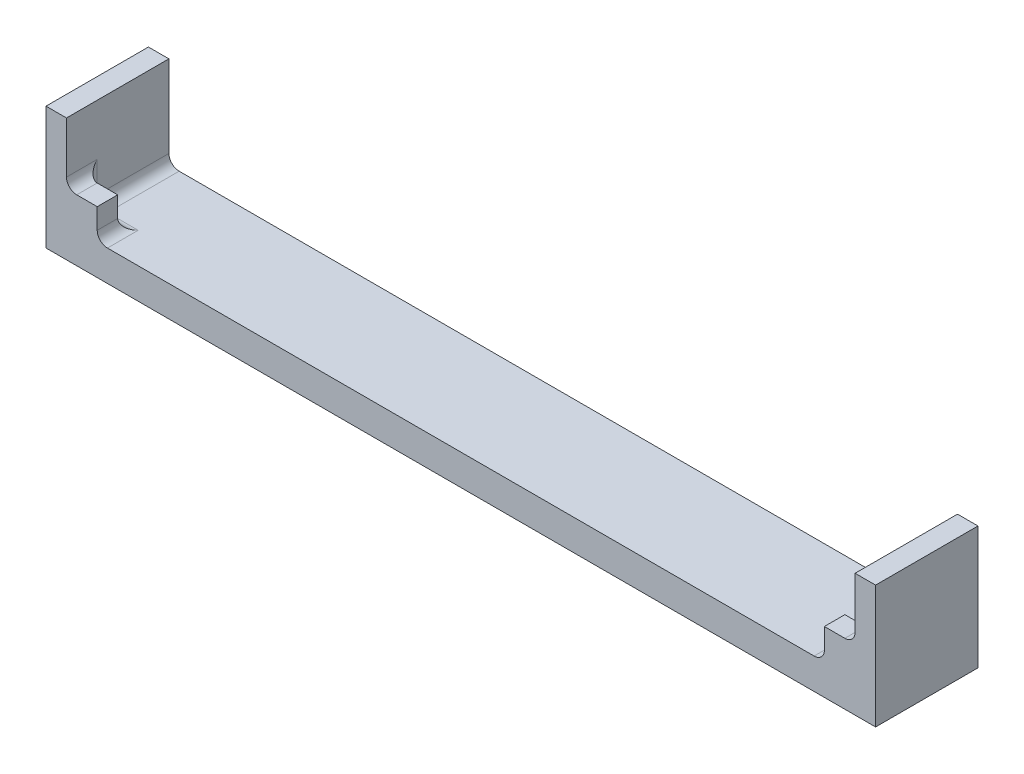
ISO-10303-21;
HEADER;
FILE_DESCRIPTION(('STEP AP214'),'2;1');
FILE_NAME('part.step','',(''),(''),'','','');
FILE_SCHEMA(('AUTOMOTIVE_DESIGN { 1 0 10303 214 1 1 1 1 }'));
ENDSEC;
DATA;
#1=APPLICATION_CONTEXT('core data for automotive mechanical design processes');
#2=APPLICATION_PROTOCOL_DEFINITION('international standard','automotive_design',2000,#1);
#3=PRODUCT_CONTEXT('',#1,'mechanical');
#4=PRODUCT('Part','Part','',(#3));
#5=PRODUCT_RELATED_PRODUCT_CATEGORY('part','',(#4));
#6=PRODUCT_DEFINITION_FORMATION('','',#4);
#7=PRODUCT_DEFINITION_CONTEXT('part definition',#1,'design');
#8=PRODUCT_DEFINITION('design','',#6,#7);
#9=PRODUCT_DEFINITION_SHAPE('','',#8);
#10=(LENGTH_UNIT() NAMED_UNIT(*) SI_UNIT(.MILLI.,.METRE.));
#11=(NAMED_UNIT(*) PLANE_ANGLE_UNIT() SI_UNIT($,.RADIAN.));
#12=(NAMED_UNIT(*) SI_UNIT($,.STERADIAN.) SOLID_ANGLE_UNIT());
#13=UNCERTAINTY_MEASURE_WITH_UNIT(LENGTH_MEASURE(1.E-05),#10,'distance_accuracy_value','');
#14=(GEOMETRIC_REPRESENTATION_CONTEXT(3) GLOBAL_UNCERTAINTY_ASSIGNED_CONTEXT((#13)) GLOBAL_UNIT_ASSIGNED_CONTEXT((#10,
#11,#12)) REPRESENTATION_CONTEXT('',''));
#15=CARTESIAN_POINT('',(0.,0.,0.));
#16=DIRECTION('',(0.,0.,1.));
#17=DIRECTION('',(1.,0.,0.));
#18=AXIS2_PLACEMENT_3D('',#15,#16,#17);
#19=CARTESIAN_POINT('',(0.,3.,0.));
#20=DIRECTION('',(0.,-1.,0.));
#21=DIRECTION('',(0.,0.,-1.));
#22=AXIS2_PLACEMENT_3D('',#19,#20,#21);
#23=PLANE('',#22);
#24=DIRECTION('',(0.,0.,1.));
#25=VECTOR('',#24,1.);
#26=CARTESIAN_POINT('',(75.,3.,0.));
#27=LINE('',#26,#25);
#28=CARTESIAN_POINT('',(75.,3.,0.));
#29=VERTEX_POINT('',#28);
#30=CARTESIAN_POINT('',(75.,3.,-3.));
#31=VERTEX_POINT('',#30);
#32=EDGE_CURVE('E346',#29,#31,#27,.F.);
#33=ORIENTED_EDGE('',*,*,#32,.T.);
#34=DIRECTION('',(1.,0.,0.));
#35=VECTOR('',#34,1.);
#36=CARTESIAN_POINT('',(78.,3.,-3.));
#37=LINE('',#36,#35);
#38=CARTESIAN_POINT('',(78.,3.,-3.));
#39=VERTEX_POINT('',#38);
#40=EDGE_CURVE('E349',#31,#39,#37,.T.);
#41=ORIENTED_EDGE('',*,*,#40,.T.);
#42=DIRECTION('',(0.,0.,1.));
#43=VECTOR('',#42,1.);
#44=CARTESIAN_POINT('',(78.,3.,-10.));
#45=LINE('',#44,#43);
#46=CARTESIAN_POINT('',(78.,3.,-10.));
#47=VERTEX_POINT('',#46);
#48=EDGE_CURVE('E322',#39,#47,#45,.F.);
#49=ORIENTED_EDGE('',*,*,#48,.T.);
#50=DIRECTION('',(-1.,0.,0.));
#51=VECTOR('',#50,1.);
#52=CARTESIAN_POINT('',(0.,3.,-10.));
#53=LINE('',#52,#51);
#54=CARTESIAN_POINT('',(3.,3.,-10.));
#55=VERTEX_POINT('',#54);
#56=EDGE_CURVE('E287',#47,#55,#53,.T.);
#57=ORIENTED_EDGE('',*,*,#56,.T.);
#58=DIRECTION('',(0.,0.,-1.));
#59=VECTOR('',#58,1.);
#60=CARTESIAN_POINT('',(3.,3.,-2.));
#61=LINE('',#60,#59);
#62=CARTESIAN_POINT('',(3.,3.,-3.));
#63=VERTEX_POINT('',#62);
#64=EDGE_CURVE('E325',#55,#63,#61,.F.);
#65=ORIENTED_EDGE('',*,*,#64,.T.);
#66=DIRECTION('',(1.,0.,0.));
#67=VECTOR('',#66,1.);
#68=CARTESIAN_POINT('',(0.,3.,-3.));
#69=LINE('',#68,#67);
#70=CARTESIAN_POINT('',(6.,3.,-3.));
#71=VERTEX_POINT('',#70);
#72=EDGE_CURVE('E342',#63,#71,#69,.T.);
#73=ORIENTED_EDGE('',*,*,#72,.T.);
#74=DIRECTION('',(0.,0.,1.));
#75=VECTOR('',#74,1.);
#76=CARTESIAN_POINT('',(6.,3.,0.));
#77=LINE('',#76,#75);
#78=CARTESIAN_POINT('',(6.,3.,0.));
#79=VERTEX_POINT('',#78);
#80=EDGE_CURVE('E339',#71,#79,#77,.T.);
#81=ORIENTED_EDGE('',*,*,#80,.T.);
#82=DIRECTION('',(1.,0.,0.));
#83=VECTOR('',#82,1.);
#84=CARTESIAN_POINT('',(0.,3.,0.));
#85=LINE('',#84,#83);
#86=EDGE_CURVE('E283',#79,#29,#85,.T.);
#87=ORIENTED_EDGE('',*,*,#86,.T.);
#88=EDGE_LOOP('',(#33,#41,#49,#57,#65,#73,#81,#87));
#89=FACE_BOUND('',#88,.T.);
#90=ADVANCED_FACE('F41',(#89),#23,.F.);
#91=CARTESIAN_POINT('',(0.,3.,0.));
#92=DIRECTION('',(1.,0.,0.));
#93=DIRECTION('',(0.,0.,-1.));
#94=AXIS2_PLACEMENT_3D('',#91,#92,#93);
#95=PLANE('',#94);
#96=DIRECTION('',(0.,0.,1.));
#97=VECTOR('',#96,1.);
#98=CARTESIAN_POINT('',(0.,0.,0.));
#99=LINE('',#98,#97);
#100=CARTESIAN_POINT('',(0.,0.,-10.));
#101=VERTEX_POINT('',#100);
#102=CARTESIAN_POINT('',(0.,0.,0.));
#103=VERTEX_POINT('',#102);
#104=EDGE_CURVE('E282',#101,#103,#99,.T.);
#105=ORIENTED_EDGE('',*,*,#104,.T.);
#106=DIRECTION('',(0.,-1.,0.));
#107=VECTOR('',#106,1.);
#108=CARTESIAN_POINT('',(0.,3.,0.));
#109=LINE('',#108,#107);
#110=CARTESIAN_POINT('',(0.,12.,0.));
#111=VERTEX_POINT('',#110);
#112=EDGE_CURVE('E315',#111,#103,#109,.T.);
#113=ORIENTED_EDGE('',*,*,#112,.F.);
#114=DIRECTION('',(0.,0.,1.));
#115=VECTOR('',#114,1.);
#116=CARTESIAN_POINT('',(0.,12.,-10.));
#117=LINE('',#116,#115);
#118=CARTESIAN_POINT('',(0.,12.,-10.));
#119=VERTEX_POINT('',#118);
#120=EDGE_CURVE('E261',#119,#111,#117,.T.);
#121=ORIENTED_EDGE('',*,*,#120,.F.);
#122=DIRECTION('',(0.,-1.,0.));
#123=VECTOR('',#122,1.);
#124=CARTESIAN_POINT('',(0.,3.,-10.));
#125=LINE('',#124,#123);
#126=EDGE_CURVE('E292',#119,#101,#125,.T.);
#127=ORIENTED_EDGE('',*,*,#126,.T.);
#128=EDGE_LOOP('',(#105,#113,#121,#127));
#129=FACE_BOUND('',#128,.T.);
#130=ADVANCED_FACE('F475',(#129),#95,.F.);
#131=CARTESIAN_POINT('',(0.,3.,0.));
#132=DIRECTION('',(0.,0.,-1.));
#133=DIRECTION('',(-1.,0.,0.));
#134=AXIS2_PLACEMENT_3D('',#131,#132,#133);
#135=PLANE('',#134);
#136=ORIENTED_EDGE('',*,*,#86,.F.);
#137=CARTESIAN_POINT('',(6.,4.,0.));
#138=DIRECTION('',(0.,0.,-1.));
#139=DIRECTION('',(-1.,0.,0.));
#140=AXIS2_PLACEMENT_3D('',#137,#138,#139);
#141=CIRCLE('',#140,1.);
#142=CARTESIAN_POINT('',(5.,4.,0.));
#143=VERTEX_POINT('',#142);
#144=EDGE_CURVE('E11',#79,#143,#141,.T.);
#145=ORIENTED_EDGE('',*,*,#144,.T.);
#146=DIRECTION('',(0.,1.,0.));
#147=VECTOR('',#146,1.);
#148=CARTESIAN_POINT('',(5.,3.,0.));
#149=LINE('',#148,#147);
#150=CARTESIAN_POINT('',(5.,6.,0.));
#151=VERTEX_POINT('',#150);
#152=EDGE_CURVE('E208',#143,#151,#149,.T.);
#153=ORIENTED_EDGE('',*,*,#152,.T.);
#154=DIRECTION('',(-1.,0.,0.));
#155=VECTOR('',#154,1.);
#156=CARTESIAN_POINT('',(2.,6.,0.));
#157=LINE('',#156,#155);
#158=CARTESIAN_POINT('',(3.,6.,0.));
#159=VERTEX_POINT('',#158);
#160=EDGE_CURVE('E226',#151,#159,#157,.T.);
#161=ORIENTED_EDGE('',*,*,#160,.T.);
#162=CARTESIAN_POINT('',(3.,7.,0.));
#163=DIRECTION('',(0.,0.,-1.));
#164=DIRECTION('',(-1.,0.,0.));
#165=AXIS2_PLACEMENT_3D('',#162,#163,#164);
#166=CIRCLE('',#165,1.);
#167=CARTESIAN_POINT('',(2.,7.,0.));
#168=VERTEX_POINT('',#167);
#169=EDGE_CURVE('E51',#159,#168,#166,.T.);
#170=ORIENTED_EDGE('',*,*,#169,.T.);
#171=DIRECTION('',(0.,-1.,0.));
#172=VECTOR('',#171,1.);
#173=CARTESIAN_POINT('',(2.,12.,0.));
#174=LINE('',#173,#172);
#175=CARTESIAN_POINT('',(2.,12.,0.));
#176=VERTEX_POINT('',#175);
#177=EDGE_CURVE('E279',#176,#168,#174,.T.);
#178=ORIENTED_EDGE('',*,*,#177,.F.);
#179=DIRECTION('',(1.,0.,0.));
#180=VECTOR('',#179,1.);
#181=CARTESIAN_POINT('',(0.,12.,0.));
#182=LINE('',#181,#180);
#183=EDGE_CURVE('E265',#111,#176,#182,.T.);
#184=ORIENTED_EDGE('',*,*,#183,.F.);
#185=ORIENTED_EDGE('',*,*,#112,.T.);
#186=DIRECTION('',(1.,0.,0.));
#187=VECTOR('',#186,1.);
#188=CARTESIAN_POINT('',(0.,0.,0.));
#189=LINE('',#188,#187);
#190=CARTESIAN_POINT('',(81.,0.,0.));
#191=VERTEX_POINT('',#190);
#192=EDGE_CURVE('E296',#103,#191,#189,.T.);
#193=ORIENTED_EDGE('',*,*,#192,.T.);
#194=DIRECTION('',(0.,-1.,0.));
#195=VECTOR('',#194,1.);
#196=CARTESIAN_POINT('',(81.,3.,0.));
#197=LINE('',#196,#195);
#198=CARTESIAN_POINT('',(81.,12.,0.));
#199=VERTEX_POINT('',#198);
#200=EDGE_CURVE('E311',#199,#191,#197,.T.);
#201=ORIENTED_EDGE('',*,*,#200,.F.);
#202=DIRECTION('',(1.,0.,0.));
#203=VECTOR('',#202,1.);
#204=CARTESIAN_POINT('',(81.,12.,0.));
#205=LINE('',#204,#203);
#206=CARTESIAN_POINT('',(79.,12.,0.));
#207=VERTEX_POINT('',#206);
#208=EDGE_CURVE('E249',#207,#199,#205,.T.);
#209=ORIENTED_EDGE('',*,*,#208,.F.);
#210=DIRECTION('',(0.,-1.,0.));
#211=VECTOR('',#210,1.);
#212=CARTESIAN_POINT('',(79.,12.,0.));
#213=LINE('',#212,#211);
#214=CARTESIAN_POINT('',(79.,7.,0.));
#215=VERTEX_POINT('',#214);
#216=EDGE_CURVE('E253',#207,#215,#213,.T.);
#217=ORIENTED_EDGE('',*,*,#216,.T.);
#218=CARTESIAN_POINT('',(78.,7.,0.));
#219=DIRECTION('',(0.,0.,-1.));
#220=DIRECTION('',(-1.,0.,0.));
#221=AXIS2_PLACEMENT_3D('',#218,#219,#220);
#222=CIRCLE('',#221,1.);
#223=CARTESIAN_POINT('',(78.,6.,0.));
#224=VERTEX_POINT('',#223);
#225=EDGE_CURVE('E395',#215,#224,#222,.T.);
#226=ORIENTED_EDGE('',*,*,#225,.T.);
#227=DIRECTION('',(-1.,0.,0.));
#228=VECTOR('',#227,1.);
#229=CARTESIAN_POINT('',(79.,6.,0.));
#230=LINE('',#229,#228);
#231=CARTESIAN_POINT('',(76.,6.,0.));
#232=VERTEX_POINT('',#231);
#233=EDGE_CURVE('E216',#224,#232,#230,.T.);
#234=ORIENTED_EDGE('',*,*,#233,.T.);
#235=DIRECTION('',(0.,-1.,0.));
#236=VECTOR('',#235,1.);
#237=CARTESIAN_POINT('',(76.,3.,0.));
#238=LINE('',#237,#236);
#239=CARTESIAN_POINT('',(76.,4.,0.));
#240=VERTEX_POINT('',#239);
#241=EDGE_CURVE('E200',#232,#240,#238,.T.);
#242=ORIENTED_EDGE('',*,*,#241,.T.);
#243=CARTESIAN_POINT('',(75.,4.,0.));
#244=DIRECTION('',(0.,0.,-1.));
#245=DIRECTION('',(-1.,0.,0.));
#246=AXIS2_PLACEMENT_3D('',#243,#244,#245);
#247=CIRCLE('',#246,1.);
#248=EDGE_CURVE('E392',#240,#29,#247,.T.);
#249=ORIENTED_EDGE('',*,*,#248,.T.);
#250=EDGE_LOOP('',(#136,#145,#153,#161,#170,#178,#184,#185,#193,#201,#209,#217,#226,#234,#242,#249));
#251=FACE_BOUND('',#250,.T.);
#252=ADVANCED_FACE('F441',(#251),#135,.F.);
#253=CARTESIAN_POINT('',(81.,3.,0.));
#254=DIRECTION('',(-1.,0.,0.));
#255=DIRECTION('',(0.,0.,1.));
#256=AXIS2_PLACEMENT_3D('',#253,#254,#255);
#257=PLANE('',#256);
#258=DIRECTION('',(0.,0.,-1.));
#259=VECTOR('',#258,1.);
#260=CARTESIAN_POINT('',(81.,0.,0.));
#261=LINE('',#260,#259);
#262=CARTESIAN_POINT('',(81.,0.,-10.));
#263=VERTEX_POINT('',#262);
#264=EDGE_CURVE('E299',#191,#263,#261,.T.);
#265=ORIENTED_EDGE('',*,*,#264,.T.);
#266=DIRECTION('',(0.,-1.,0.));
#267=VECTOR('',#266,1.);
#268=CARTESIAN_POINT('',(81.,3.,-10.));
#269=LINE('',#268,#267);
#270=CARTESIAN_POINT('',(81.,12.,-10.));
#271=VERTEX_POINT('',#270);
#272=EDGE_CURVE('E307',#271,#263,#269,.T.);
#273=ORIENTED_EDGE('',*,*,#272,.F.);
#274=DIRECTION('',(0.,0.,-1.));
#275=VECTOR('',#274,1.);
#276=CARTESIAN_POINT('',(81.,12.,-10.));
#277=LINE('',#276,#275);
#278=EDGE_CURVE('E239',#199,#271,#277,.T.);
#279=ORIENTED_EDGE('',*,*,#278,.F.);
#280=ORIENTED_EDGE('',*,*,#200,.T.);
#281=EDGE_LOOP('',(#265,#273,#279,#280));
#282=FACE_BOUND('',#281,.T.);
#283=ADVANCED_FACE('F483',(#282),#257,.F.);
#284=CARTESIAN_POINT('',(0.,3.,-10.));
#285=DIRECTION('',(0.,0.,1.));
#286=DIRECTION('',(1.,0.,0.));
#287=AXIS2_PLACEMENT_3D('',#284,#285,#286);
#288=PLANE('',#287);
#289=DIRECTION('',(-1.,0.,0.));
#290=VECTOR('',#289,1.);
#291=CARTESIAN_POINT('',(0.,0.,-10.));
#292=LINE('',#291,#290);
#293=EDGE_CURVE('E288',#263,#101,#292,.T.);
#294=ORIENTED_EDGE('',*,*,#293,.T.);
#295=ORIENTED_EDGE('',*,*,#126,.F.);
#296=DIRECTION('',(-1.,0.,0.));
#297=VECTOR('',#296,1.);
#298=CARTESIAN_POINT('',(0.,12.,-10.));
#299=LINE('',#298,#297);
#300=CARTESIAN_POINT('',(2.,12.,-10.));
#301=VERTEX_POINT('',#300);
#302=EDGE_CURVE('E271',#301,#119,#299,.T.);
#303=ORIENTED_EDGE('',*,*,#302,.F.);
#304=DIRECTION('',(0.,-1.,0.));
#305=VECTOR('',#304,1.);
#306=CARTESIAN_POINT('',(2.,12.,-10.));
#307=LINE('',#306,#305);
#308=CARTESIAN_POINT('',(2.,4.,-10.));
#309=VERTEX_POINT('',#308);
#310=EDGE_CURVE('E275',#301,#309,#307,.T.);
#311=ORIENTED_EDGE('',*,*,#310,.T.);
#312=CARTESIAN_POINT('',(3.,4.,-10.));
#313=DIRECTION('',(0.,0.,1.));
#314=DIRECTION('',(1.,0.,0.));
#315=AXIS2_PLACEMENT_3D('',#312,#313,#314);
#316=CIRCLE('',#315,1.);
#317=EDGE_CURVE('E333',#309,#55,#316,.T.);
#318=ORIENTED_EDGE('',*,*,#317,.T.);
#319=ORIENTED_EDGE('',*,*,#56,.F.);
#320=CARTESIAN_POINT('',(78.,4.,-10.));
#321=DIRECTION('',(0.,0.,1.));
#322=DIRECTION('',(1.,0.,0.));
#323=AXIS2_PLACEMENT_3D('',#320,#321,#322);
#324=CIRCLE('',#323,1.);
#325=CARTESIAN_POINT('',(79.,4.,-10.));
#326=VERTEX_POINT('',#325);
#327=EDGE_CURVE('E336',#47,#326,#324,.T.);
#328=ORIENTED_EDGE('',*,*,#327,.T.);
#329=DIRECTION('',(0.,-1.,0.));
#330=VECTOR('',#329,1.);
#331=CARTESIAN_POINT('',(79.,12.,-10.));
#332=LINE('',#331,#330);
#333=CARTESIAN_POINT('',(79.,12.,-10.));
#334=VERTEX_POINT('',#333);
#335=EDGE_CURVE('E257',#334,#326,#332,.T.);
#336=ORIENTED_EDGE('',*,*,#335,.F.);
#337=DIRECTION('',(-1.,0.,0.));
#338=VECTOR('',#337,1.);
#339=CARTESIAN_POINT('',(81.,12.,-10.));
#340=LINE('',#339,#338);
#341=EDGE_CURVE('E243',#271,#334,#340,.T.);
#342=ORIENTED_EDGE('',*,*,#341,.F.);
#343=ORIENTED_EDGE('',*,*,#272,.T.);
#344=EDGE_LOOP('',(#294,#295,#303,#311,#318,#319,#328,#336,#342,#343));
#345=FACE_BOUND('',#344,.T.);
#346=ADVANCED_FACE('F470',(#345),#288,.F.);
#347=CARTESIAN_POINT('',(0.,0.,0.));
#348=DIRECTION('',(0.,-1.,0.));
#349=DIRECTION('',(0.,0.,-1.));
#350=AXIS2_PLACEMENT_3D('',#347,#348,#349);
#351=PLANE('',#350);
#352=ORIENTED_EDGE('',*,*,#104,.F.);
#353=ORIENTED_EDGE('',*,*,#293,.F.);
#354=ORIENTED_EDGE('',*,*,#264,.F.);
#355=ORIENTED_EDGE('',*,*,#192,.F.);
#356=EDGE_LOOP('',(#352,#353,#354,#355));
#357=FACE_BOUND('',#356,.T.);
#358=ADVANCED_FACE('F485',(#357),#351,.T.);
#359=CARTESIAN_POINT('',(2.,12.,-10.));
#360=DIRECTION('',(-1.,0.,0.));
#361=DIRECTION('',(0.,0.,1.));
#362=AXIS2_PLACEMENT_3D('',#359,#360,#361);
#363=PLANE('',#362);
#364=ORIENTED_EDGE('',*,*,#177,.T.);
#365=DIRECTION('',(0.,0.,1.));
#366=VECTOR('',#365,1.);
#367=CARTESIAN_POINT('',(2.,7.,-10.));
#368=LINE('',#367,#366);
#369=CARTESIAN_POINT('',(2.,7.,-3.));
#370=VERTEX_POINT('',#369);
#371=EDGE_CURVE('E65',#168,#370,#368,.F.);
#372=ORIENTED_EDGE('',*,*,#371,.T.);
#373=DIRECTION('',(0.,-1.,0.));
#374=VECTOR('',#373,1.);
#375=CARTESIAN_POINT('',(2.,12.,-3.));
#376=LINE('',#375,#374);
#377=CARTESIAN_POINT('',(2.,4.,-3.));
#378=VERTEX_POINT('',#377);
#379=EDGE_CURVE('E384',#370,#378,#376,.T.);
#380=ORIENTED_EDGE('',*,*,#379,.T.);
#381=DIRECTION('',(0.,0.,-1.));
#382=VECTOR('',#381,1.);
#383=CARTESIAN_POINT('',(2.,4.,-10.));
#384=LINE('',#383,#382);
#385=EDGE_CURVE('E319',#378,#309,#384,.T.);
#386=ORIENTED_EDGE('',*,*,#385,.T.);
#387=ORIENTED_EDGE('',*,*,#310,.F.);
#388=DIRECTION('',(0.,0.,-1.));
#389=VECTOR('',#388,1.);
#390=CARTESIAN_POINT('',(2.,12.,-10.));
#391=LINE('',#390,#389);
#392=EDGE_CURVE('E268',#176,#301,#391,.T.);
#393=ORIENTED_EDGE('',*,*,#392,.F.);
#394=EDGE_LOOP('',(#364,#372,#380,#386,#387,#393));
#395=FACE_BOUND('',#394,.T.);
#396=ADVANCED_FACE('F466',(#395),#363,.F.);
#397=CARTESIAN_POINT('',(0.,12.,0.));
#398=DIRECTION('',(0.,1.,0.));
#399=DIRECTION('',(0.,0.,1.));
#400=AXIS2_PLACEMENT_3D('',#397,#398,#399);
#401=PLANE('',#400);
#402=ORIENTED_EDGE('',*,*,#120,.T.);
#403=ORIENTED_EDGE('',*,*,#183,.T.);
#404=ORIENTED_EDGE('',*,*,#392,.T.);
#405=ORIENTED_EDGE('',*,*,#302,.T.);
#406=EDGE_LOOP('',(#402,#403,#404,#405));
#407=FACE_BOUND('',#406,.T.);
#408=ADVANCED_FACE('F473',(#407),#401,.T.);
#409=CARTESIAN_POINT('',(79.,12.,-10.));
#410=DIRECTION('',(1.,0.,0.));
#411=DIRECTION('',(0.,0.,-1.));
#412=AXIS2_PLACEMENT_3D('',#409,#410,#411);
#413=PLANE('',#412);
#414=DIRECTION('',(0.,0.,1.));
#415=VECTOR('',#414,1.);
#416=CARTESIAN_POINT('',(79.,4.,-2.));
#417=LINE('',#416,#415);
#418=CARTESIAN_POINT('',(79.,4.,-3.));
#419=VERTEX_POINT('',#418);
#420=EDGE_CURVE('E329',#326,#419,#417,.T.);
#421=ORIENTED_EDGE('',*,*,#420,.T.);
#422=DIRECTION('',(0.,1.,0.));
#423=VECTOR('',#422,1.);
#424=CARTESIAN_POINT('',(79.,6.,-3.));
#425=LINE('',#424,#423);
#426=CARTESIAN_POINT('',(79.,7.,-3.));
#427=VERTEX_POINT('',#426);
#428=EDGE_CURVE('E376',#419,#427,#425,.T.);
#429=ORIENTED_EDGE('',*,*,#428,.T.);
#430=DIRECTION('',(0.,0.,1.));
#431=VECTOR('',#430,1.);
#432=CARTESIAN_POINT('',(79.,7.,-10.));
#433=LINE('',#432,#431);
#434=EDGE_CURVE('E373',#427,#215,#433,.T.);
#435=ORIENTED_EDGE('',*,*,#434,.T.);
#436=ORIENTED_EDGE('',*,*,#216,.F.);
#437=DIRECTION('',(0.,0.,1.));
#438=VECTOR('',#437,1.);
#439=CARTESIAN_POINT('',(79.,12.,-10.));
#440=LINE('',#439,#438);
#441=EDGE_CURVE('E246',#334,#207,#440,.T.);
#442=ORIENTED_EDGE('',*,*,#441,.F.);
#443=ORIENTED_EDGE('',*,*,#335,.T.);
#444=EDGE_LOOP('',(#421,#429,#435,#436,#442,#443));
#445=FACE_BOUND('',#444,.T.);
#446=ADVANCED_FACE('F516',(#445),#413,.F.);
#447=CARTESIAN_POINT('',(0.,12.,0.));
#448=DIRECTION('',(0.,-1.,0.));
#449=DIRECTION('',(0.,0.,-1.));
#450=AXIS2_PLACEMENT_3D('',#447,#448,#449);
#451=PLANE('',#450);
#452=ORIENTED_EDGE('',*,*,#278,.T.);
#453=ORIENTED_EDGE('',*,*,#341,.T.);
#454=ORIENTED_EDGE('',*,*,#441,.T.);
#455=ORIENTED_EDGE('',*,*,#208,.T.);
#456=EDGE_LOOP('',(#452,#453,#454,#455));
#457=FACE_BOUND('',#456,.T.);
#458=ADVANCED_FACE('F490',(#457),#451,.F.);
#459=CARTESIAN_POINT('',(2.,6.,-2.));
#460=DIRECTION('',(0.,1.,0.));
#461=DIRECTION('',(0.,0.,1.));
#462=AXIS2_PLACEMENT_3D('',#459,#460,#461);
#463=PLANE('',#462);
#464=DIRECTION('',(-1.,0.,0.));
#465=VECTOR('',#464,1.);
#466=CARTESIAN_POINT('',(2.,6.,-2.));
#467=LINE('',#466,#465);
#468=CARTESIAN_POINT('',(5.,6.,-2.));
#469=VERTEX_POINT('',#468);
#470=CARTESIAN_POINT('',(3.,6.,-2.));
#471=VERTEX_POINT('',#470);
#472=EDGE_CURVE('E225',#469,#471,#467,.T.);
#473=ORIENTED_EDGE('',*,*,#472,.T.);
#474=DIRECTION('',(0.,0.,1.));
#475=VECTOR('',#474,1.);
#476=CARTESIAN_POINT('',(3.,6.,-2.));
#477=LINE('',#476,#475);
#478=EDGE_CURVE('E381',#471,#159,#477,.T.);
#479=ORIENTED_EDGE('',*,*,#478,.T.);
#480=ORIENTED_EDGE('',*,*,#160,.F.);
#481=DIRECTION('',(0.,0.,1.));
#482=VECTOR('',#481,1.);
#483=CARTESIAN_POINT('',(5.,6.,-2.));
#484=LINE('',#483,#482);
#485=EDGE_CURVE('E230',#469,#151,#484,.T.);
#486=ORIENTED_EDGE('',*,*,#485,.F.);
#487=EDGE_LOOP('',(#473,#479,#480,#486));
#488=FACE_BOUND('',#487,.T.);
#489=ADVANCED_FACE('F438',(#488),#463,.T.);
#490=CARTESIAN_POINT('',(5.,3.,-2.));
#491=DIRECTION('',(1.,0.,0.));
#492=DIRECTION('',(0.,0.,-1.));
#493=AXIS2_PLACEMENT_3D('',#490,#491,#492);
#494=PLANE('',#493);
#495=ORIENTED_EDGE('',*,*,#152,.F.);
#496=DIRECTION('',(0.,0.,1.));
#497=VECTOR('',#496,1.);
#498=CARTESIAN_POINT('',(5.,4.,-2.));
#499=LINE('',#498,#497);
#500=CARTESIAN_POINT('',(5.,4.,-2.));
#501=VERTEX_POINT('',#500);
#502=EDGE_CURVE('E389',#143,#501,#499,.F.);
#503=ORIENTED_EDGE('',*,*,#502,.T.);
#504=DIRECTION('',(0.,1.,0.));
#505=VECTOR('',#504,1.);
#506=CARTESIAN_POINT('',(5.,3.,-2.));
#507=LINE('',#506,#505);
#508=EDGE_CURVE('E222',#501,#469,#507,.T.);
#509=ORIENTED_EDGE('',*,*,#508,.T.);
#510=ORIENTED_EDGE('',*,*,#485,.T.);
#511=EDGE_LOOP('',(#495,#503,#509,#510));
#512=FACE_BOUND('',#511,.T.);
#513=ADVANCED_FACE('F445',(#512),#494,.T.);
#514=CARTESIAN_POINT('',(0.,0.,-2.));
#515=DIRECTION('',(0.,0.,-1.));
#516=DIRECTION('',(-1.,0.,0.));
#517=AXIS2_PLACEMENT_3D('',#514,#515,#516);
#518=PLANE('',#517);
#519=ORIENTED_EDGE('',*,*,#508,.F.);
#520=DIRECTION('',(1.,0.,0.));
#521=VECTOR('',#520,1.);
#522=CARTESIAN_POINT('',(0.,4.,-2.));
#523=LINE('',#522,#521);
#524=CARTESIAN_POINT('',(3.,4.,-2.));
#525=VERTEX_POINT('',#524);
#526=EDGE_CURVE('E364',#501,#525,#523,.F.);
#527=ORIENTED_EDGE('',*,*,#526,.T.);
#528=DIRECTION('',(0.,-1.,0.));
#529=VECTOR('',#528,1.);
#530=CARTESIAN_POINT('',(3.,0.,-2.));
#531=LINE('',#530,#529);
#532=EDGE_CURVE('E361',#525,#471,#531,.F.);
#533=ORIENTED_EDGE('',*,*,#532,.T.);
#534=ORIENTED_EDGE('',*,*,#472,.F.);
#535=EDGE_LOOP('',(#519,#527,#533,#534));
#536=FACE_BOUND('',#535,.T.);
#537=ADVANCED_FACE('F448',(#536),#518,.T.);
#538=CARTESIAN_POINT('',(76.,3.,-2.));
#539=DIRECTION('',(-1.,0.,0.));
#540=DIRECTION('',(0.,0.,1.));
#541=AXIS2_PLACEMENT_3D('',#538,#539,#540);
#542=PLANE('',#541);
#543=DIRECTION('',(0.,-1.,0.));
#544=VECTOR('',#543,1.);
#545=CARTESIAN_POINT('',(76.,3.,-2.));
#546=LINE('',#545,#544);
#547=CARTESIAN_POINT('',(76.,6.,-2.));
#548=VERTEX_POINT('',#547);
#549=CARTESIAN_POINT('',(76.,4.,-2.));
#550=VERTEX_POINT('',#549);
#551=EDGE_CURVE('E199',#548,#550,#546,.T.);
#552=ORIENTED_EDGE('',*,*,#551,.T.);
#553=DIRECTION('',(0.,0.,1.));
#554=VECTOR('',#553,1.);
#555=CARTESIAN_POINT('',(76.,4.,-2.));
#556=LINE('',#555,#554);
#557=EDGE_CURVE('E370',#550,#240,#556,.T.);
#558=ORIENTED_EDGE('',*,*,#557,.T.);
#559=ORIENTED_EDGE('',*,*,#241,.F.);
#560=DIRECTION('',(0.,0.,1.));
#561=VECTOR('',#560,1.);
#562=CARTESIAN_POINT('',(76.,6.,-2.));
#563=LINE('',#562,#561);
#564=EDGE_CURVE('E191',#548,#232,#563,.T.);
#565=ORIENTED_EDGE('',*,*,#564,.F.);
#566=EDGE_LOOP('',(#552,#558,#559,#565));
#567=FACE_BOUND('',#566,.T.);
#568=ADVANCED_FACE('F204',(#567),#542,.T.);
#569=CARTESIAN_POINT('',(79.,6.,-2.));
#570=DIRECTION('',(0.,1.,0.));
#571=DIRECTION('',(0.,0.,1.));
#572=AXIS2_PLACEMENT_3D('',#569,#570,#571);
#573=PLANE('',#572);
#574=ORIENTED_EDGE('',*,*,#233,.F.);
#575=DIRECTION('',(0.,0.,1.));
#576=VECTOR('',#575,1.);
#577=CARTESIAN_POINT('',(78.,6.,-2.));
#578=LINE('',#577,#576);
#579=CARTESIAN_POINT('',(78.,6.,-2.));
#580=VERTEX_POINT('',#579);
#581=EDGE_CURVE('E194',#224,#580,#578,.F.);
#582=ORIENTED_EDGE('',*,*,#581,.T.);
#583=DIRECTION('',(-1.,0.,0.));
#584=VECTOR('',#583,1.);
#585=CARTESIAN_POINT('',(79.,6.,-2.));
#586=LINE('',#585,#584);
#587=EDGE_CURVE('E187',#580,#548,#586,.T.);
#588=ORIENTED_EDGE('',*,*,#587,.T.);
#589=ORIENTED_EDGE('',*,*,#564,.T.);
#590=EDGE_LOOP('',(#574,#582,#588,#589));
#591=FACE_BOUND('',#590,.T.);
#592=ADVANCED_FACE('F190',(#591),#573,.T.);
#593=CARTESIAN_POINT('',(0.,0.,-2.));
#594=DIRECTION('',(0.,0.,1.));
#595=DIRECTION('',(1.,0.,0.));
#596=AXIS2_PLACEMENT_3D('',#593,#594,#595);
#597=PLANE('',#596);
#598=DIRECTION('',(0.,1.,0.));
#599=VECTOR('',#598,1.);
#600=CARTESIAN_POINT('',(78.,4.,-2.));
#601=LINE('',#600,#599);
#602=CARTESIAN_POINT('',(78.,4.,-2.));
#603=VERTEX_POINT('',#602);
#604=EDGE_CURVE('E353',#580,#603,#601,.F.);
#605=ORIENTED_EDGE('',*,*,#604,.T.);
#606=DIRECTION('',(1.,0.,0.));
#607=VECTOR('',#606,1.);
#608=CARTESIAN_POINT('',(76.,4.,-2.));
#609=LINE('',#608,#607);
#610=EDGE_CURVE('E212',#603,#550,#609,.F.);
#611=ORIENTED_EDGE('',*,*,#610,.T.);
#612=ORIENTED_EDGE('',*,*,#551,.F.);
#613=ORIENTED_EDGE('',*,*,#587,.F.);
#614=EDGE_LOOP('',(#605,#611,#612,#613));
#615=FACE_BOUND('',#614,.T.);
#616=ADVANCED_FACE('F210',(#615),#597,.F.);
#617=CARTESIAN_POINT('',(3.,4.,-10.));
#618=DIRECTION('',(0.,0.,1.));
#619=DIRECTION('',(1.,0.,0.));
#620=AXIS2_PLACEMENT_3D('',#617,#618,#619);
#621=CYLINDRICAL_SURFACE('',#620,1.);
#622=ORIENTED_EDGE('',*,*,#385,.F.);
#623=CARTESIAN_POINT('',(3.,4.,-3.));
#624=DIRECTION('',(0.,0.,1.));
#625=DIRECTION('',(1.,0.,0.));
#626=AXIS2_PLACEMENT_3D('',#623,#624,#625);
#627=CIRCLE('',#626,1.);
#628=EDGE_CURVE('E367',#378,#63,#627,.T.);
#629=ORIENTED_EDGE('',*,*,#628,.T.);
#630=ORIENTED_EDGE('',*,*,#64,.F.);
#631=ORIENTED_EDGE('',*,*,#317,.F.);
#632=EDGE_LOOP('',(#622,#629,#630,#631));
#633=FACE_BOUND('',#632,.T.);
#634=ADVANCED_FACE('F464',(#633),#621,.F.);
#635=CARTESIAN_POINT('',(78.,4.,-10.));
#636=DIRECTION('',(0.,0.,-1.));
#637=DIRECTION('',(-1.,0.,0.));
#638=AXIS2_PLACEMENT_3D('',#635,#636,#637);
#639=CYLINDRICAL_SURFACE('',#638,1.);
#640=ORIENTED_EDGE('',*,*,#48,.F.);
#641=CARTESIAN_POINT('',(78.,4.,-3.));
#642=DIRECTION('',(0.,0.,-1.));
#643=DIRECTION('',(-1.,0.,0.));
#644=AXIS2_PLACEMENT_3D('',#641,#642,#643);
#645=CIRCLE('',#644,1.);
#646=EDGE_CURVE('E358',#39,#419,#645,.F.);
#647=ORIENTED_EDGE('',*,*,#646,.T.);
#648=ORIENTED_EDGE('',*,*,#420,.F.);
#649=ORIENTED_EDGE('',*,*,#327,.F.);
#650=EDGE_LOOP('',(#640,#647,#648,#649));
#651=FACE_BOUND('',#650,.T.);
#652=ADVANCED_FACE('F515',(#651),#639,.F.);
#653=CARTESIAN_POINT('',(78.,7.,-10.));
#654=DIRECTION('',(0.,0.,1.));
#655=DIRECTION('',(1.,0.,0.));
#656=AXIS2_PLACEMENT_3D('',#653,#654,#655);
#657=CYLINDRICAL_SURFACE('',#656,1.);
#658=ORIENTED_EDGE('',*,*,#225,.F.);
#659=ORIENTED_EDGE('',*,*,#434,.F.);
#660=CARTESIAN_POINT('',(78.,7.,-3.));
#661=DIRECTION('',(0.,0.707106781186547,0.707106781186547));
#662=DIRECTION('',(0.,-0.707106781186547,0.707106781186547));
#663=AXIS2_PLACEMENT_3D('',#660,#661,#662);
#664=ELLIPSE('',#663,1.41421356237309,1.);
#665=EDGE_CURVE('E219',#580,#427,#664,.T.);
#666=ORIENTED_EDGE('',*,*,#665,.F.);
#667=ORIENTED_EDGE('',*,*,#581,.F.);
#668=EDGE_LOOP('',(#658,#659,#666,#667));
#669=FACE_BOUND('',#668,.T.);
#670=ADVANCED_FACE('F496',(#669),#657,.F.);
#671=CARTESIAN_POINT('',(78.,12.,-3.));
#672=DIRECTION('',(0.,-1.,0.));
#673=DIRECTION('',(0.,0.,-1.));
#674=AXIS2_PLACEMENT_3D('',#671,#672,#673);
#675=CYLINDRICAL_SURFACE('',#674,1.);
#676=ORIENTED_EDGE('',*,*,#665,.T.);
#677=ORIENTED_EDGE('',*,*,#428,.F.);
#678=CARTESIAN_POINT('',(78.,4.,-3.));
#679=DIRECTION('',(0.,1.,0.));
#680=DIRECTION('',(0.,0.,1.));
#681=AXIS2_PLACEMENT_3D('',#678,#679,#680);
#682=CIRCLE('',#681,1.);
#683=EDGE_CURVE('E407',#603,#419,#682,.T.);
#684=ORIENTED_EDGE('',*,*,#683,.F.);
#685=ORIENTED_EDGE('',*,*,#604,.F.);
#686=EDGE_LOOP('',(#676,#677,#684,#685));
#687=FACE_BOUND('',#686,.T.);
#688=ADVANCED_FACE('F501',(#687),#675,.F.);
#689=CARTESIAN_POINT('',(75.,4.,-2.));
#690=DIRECTION('',(0.,0.,1.));
#691=DIRECTION('',(1.,0.,0.));
#692=AXIS2_PLACEMENT_3D('',#689,#690,#691);
#693=CYLINDRICAL_SURFACE('',#692,1.);
#694=ORIENTED_EDGE('',*,*,#248,.F.);
#695=ORIENTED_EDGE('',*,*,#557,.F.);
#696=CARTESIAN_POINT('',(75.,4.,-3.));
#697=DIRECTION('',(-0.707106781186547,0.,0.707106781186547));
#698=DIRECTION('',(0.707106781186547,0.,0.707106781186547));
#699=AXIS2_PLACEMENT_3D('',#696,#697,#698);
#700=ELLIPSE('',#699,1.41421356237309,1.);
#701=EDGE_CURVE('E403',#31,#550,#700,.T.);
#702=ORIENTED_EDGE('',*,*,#701,.F.);
#703=ORIENTED_EDGE('',*,*,#32,.F.);
#704=EDGE_LOOP('',(#694,#695,#702,#703));
#705=FACE_BOUND('',#704,.T.);
#706=ADVANCED_FACE('F549',(#705),#693,.F.);
#707=CARTESIAN_POINT('',(78.,4.,-3.));
#708=DIRECTION('',(0.,0.,1.));
#709=DIRECTION('',(1.,0.,0.));
#710=AXIS2_PLACEMENT_3D('',#707,#708,#709);
#711=SPHERICAL_SURFACE('',#710,1.);
#712=ORIENTED_EDGE('',*,*,#683,.T.);
#713=ORIENTED_EDGE('',*,*,#646,.F.);
#714=CARTESIAN_POINT('',(78.,4.,-3.));
#715=DIRECTION('',(1.,0.,0.));
#716=DIRECTION('',(0.,0.,-1.));
#717=AXIS2_PLACEMENT_3D('',#714,#715,#716);
#718=CIRCLE('',#717,1.);
#719=EDGE_CURVE('E400',#603,#39,#718,.T.);
#720=ORIENTED_EDGE('',*,*,#719,.F.);
#721=EDGE_LOOP('',(#712,#713,#720));
#722=FACE_BOUND('',#721,.T.);
#723=ADVANCED_FACE('F509',(#722),#711,.F.);
#724=CARTESIAN_POINT('',(0.,4.,-3.));
#725=DIRECTION('',(-1.,0.,0.));
#726=DIRECTION('',(0.,0.,1.));
#727=AXIS2_PLACEMENT_3D('',#724,#725,#726);
#728=CYLINDRICAL_SURFACE('',#727,1.);
#729=ORIENTED_EDGE('',*,*,#701,.T.);
#730=ORIENTED_EDGE('',*,*,#610,.F.);
#731=ORIENTED_EDGE('',*,*,#719,.T.);
#732=ORIENTED_EDGE('',*,*,#40,.F.);
#733=EDGE_LOOP('',(#729,#730,#731,#732));
#734=FACE_BOUND('',#733,.T.);
#735=ADVANCED_FACE('F506',(#734),#728,.F.);
#736=CARTESIAN_POINT('',(3.,7.,-2.));
#737=DIRECTION('',(0.,0.,1.));
#738=DIRECTION('',(1.,0.,0.));
#739=AXIS2_PLACEMENT_3D('',#736,#737,#738);
#740=CYLINDRICAL_SURFACE('',#739,1.);
#741=ORIENTED_EDGE('',*,*,#169,.F.);
#742=ORIENTED_EDGE('',*,*,#478,.F.);
#743=CARTESIAN_POINT('',(3.,7.,-3.));
#744=DIRECTION('',(0.,-0.707106781186547,-0.707106781186547));
#745=DIRECTION('',(0.,-0.707106781186547,0.707106781186547));
#746=AXIS2_PLACEMENT_3D('',#743,#744,#745);
#747=ELLIPSE('',#746,1.41421356237309,1.);
#748=EDGE_CURVE('E45',#370,#471,#747,.F.);
#749=ORIENTED_EDGE('',*,*,#748,.F.);
#750=ORIENTED_EDGE('',*,*,#371,.F.);
#751=EDGE_LOOP('',(#741,#742,#749,#750));
#752=FACE_BOUND('',#751,.T.);
#753=ADVANCED_FACE('F43',(#752),#740,.F.);
#754=CARTESIAN_POINT('',(3.,12.,-3.));
#755=DIRECTION('',(0.,-1.,0.));
#756=DIRECTION('',(0.,0.,-1.));
#757=AXIS2_PLACEMENT_3D('',#754,#755,#756);
#758=CYLINDRICAL_SURFACE('',#757,1.);
#759=CARTESIAN_POINT('',(3.,4.,-3.));
#760=DIRECTION('',(0.,1.,0.));
#761=DIRECTION('',(0.,0.,1.));
#762=AXIS2_PLACEMENT_3D('',#759,#760,#761);
#763=CIRCLE('',#762,1.);
#764=EDGE_CURVE('E420',#378,#525,#763,.T.);
#765=ORIENTED_EDGE('',*,*,#764,.F.);
#766=ORIENTED_EDGE('',*,*,#379,.F.);
#767=ORIENTED_EDGE('',*,*,#748,.T.);
#768=ORIENTED_EDGE('',*,*,#532,.F.);
#769=EDGE_LOOP('',(#765,#766,#767,#768));
#770=FACE_BOUND('',#769,.T.);
#771=ADVANCED_FACE('F432',(#770),#758,.F.);
#772=CARTESIAN_POINT('',(3.,4.,-3.));
#773=DIRECTION('',(0.,0.,-1.));
#774=DIRECTION('',(-1.,0.,0.));
#775=AXIS2_PLACEMENT_3D('',#772,#773,#774);
#776=SPHERICAL_SURFACE('',#775,1.);
#777=ORIENTED_EDGE('',*,*,#628,.F.);
#778=ORIENTED_EDGE('',*,*,#764,.T.);
#779=CARTESIAN_POINT('',(3.,4.,-3.));
#780=DIRECTION('',(-1.,0.,0.));
#781=DIRECTION('',(0.,0.,1.));
#782=AXIS2_PLACEMENT_3D('',#779,#780,#781);
#783=CIRCLE('',#782,1.);
#784=EDGE_CURVE('E417',#63,#525,#783,.T.);
#785=ORIENTED_EDGE('',*,*,#784,.F.);
#786=EDGE_LOOP('',(#777,#778,#785));
#787=FACE_BOUND('',#786,.T.);
#788=ADVANCED_FACE('F462',(#787),#776,.F.);
#789=CARTESIAN_POINT('',(6.,4.,0.));
#790=DIRECTION('',(0.,0.,1.));
#791=DIRECTION('',(1.,0.,0.));
#792=AXIS2_PLACEMENT_3D('',#789,#790,#791);
#793=CYLINDRICAL_SURFACE('',#792,1.);
#794=ORIENTED_EDGE('',*,*,#144,.F.);
#795=ORIENTED_EDGE('',*,*,#80,.F.);
#796=CARTESIAN_POINT('',(6.,4.,-3.));
#797=DIRECTION('',(0.707106781186547,0.,0.707106781186547));
#798=DIRECTION('',(-0.707106781186547,0.,0.707106781186547));
#799=AXIS2_PLACEMENT_3D('',#796,#797,#798);
#800=ELLIPSE('',#799,1.41421356237309,1.);
#801=EDGE_CURVE('E414',#501,#71,#800,.T.);
#802=ORIENTED_EDGE('',*,*,#801,.F.);
#803=ORIENTED_EDGE('',*,*,#502,.F.);
#804=EDGE_LOOP('',(#794,#795,#802,#803));
#805=FACE_BOUND('',#804,.T.);
#806=ADVANCED_FACE('F456',(#805),#793,.F.);
#807=CARTESIAN_POINT('',(0.,4.,-3.));
#808=DIRECTION('',(1.,0.,0.));
#809=DIRECTION('',(0.,0.,-1.));
#810=AXIS2_PLACEMENT_3D('',#807,#808,#809);
#811=CYLINDRICAL_SURFACE('',#810,1.);
#812=ORIENTED_EDGE('',*,*,#784,.T.);
#813=ORIENTED_EDGE('',*,*,#526,.F.);
#814=ORIENTED_EDGE('',*,*,#801,.T.);
#815=ORIENTED_EDGE('',*,*,#72,.F.);
#816=EDGE_LOOP('',(#812,#813,#814,#815));
#817=FACE_BOUND('',#816,.T.);
#818=ADVANCED_FACE('F452',(#817),#811,.F.);
#819=CLOSED_SHELL('',(#90,#130,#252,#283,#346,#358,#396,#408,#446,#458,#489,#513,#537,#568,#592,
#616,#634,#652,#670,#688,#706,#723,#735,#753,#771,#788,#806,#818));
#820=MANIFOLD_SOLID_BREP('B2',#819);
#821=ADVANCED_BREP_SHAPE_REPRESENTATION('',(#18,#820),#14);
#822=SHAPE_DEFINITION_REPRESENTATION(#9,#821);
ENDSEC;
END-ISO-10303-21;
